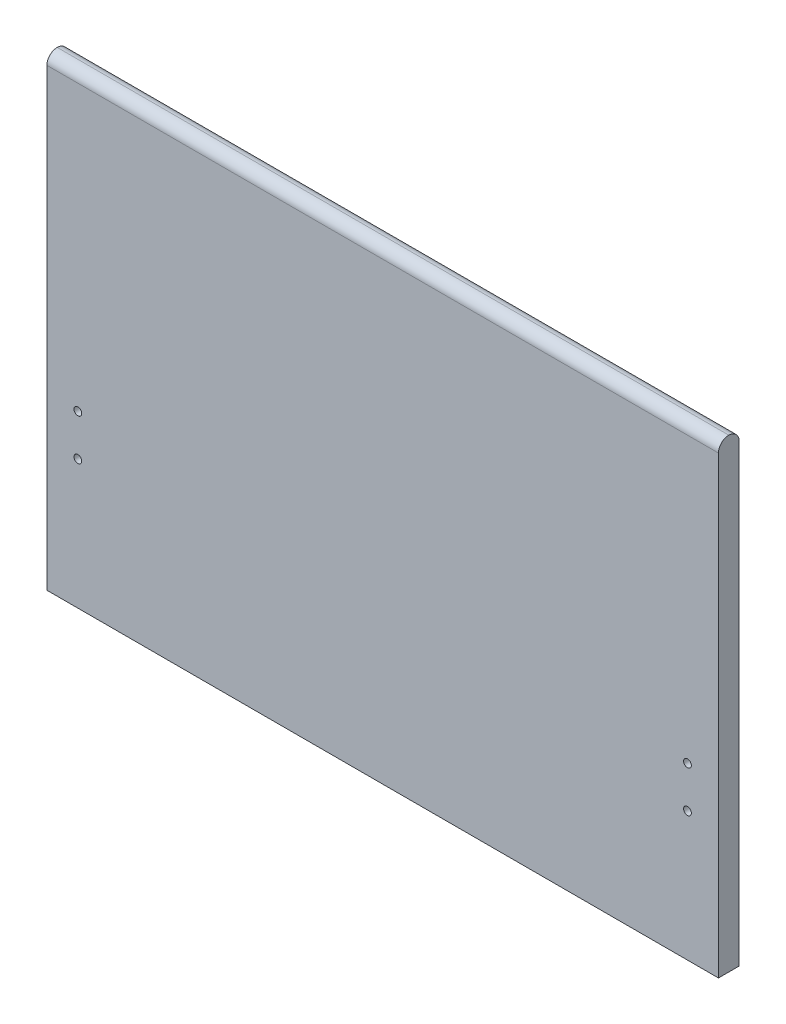
ISO-10303-21;
HEADER;
FILE_DESCRIPTION(('STEP AP214'),'2;1');
FILE_NAME('part.step','',(''),(''),'','','');
FILE_SCHEMA(('AUTOMOTIVE_DESIGN { 1 0 10303 214 1 1 1 1 }'));
ENDSEC;
DATA;
#1=APPLICATION_CONTEXT('core data for automotive mechanical design processes');
#2=APPLICATION_PROTOCOL_DEFINITION('international standard','automotive_design',2000,#1);
#3=PRODUCT_CONTEXT('',#1,'mechanical');
#4=PRODUCT('Part','Part','',(#3));
#5=PRODUCT_RELATED_PRODUCT_CATEGORY('part','',(#4));
#6=PRODUCT_DEFINITION_FORMATION('','',#4);
#7=PRODUCT_DEFINITION_CONTEXT('part definition',#1,'design');
#8=PRODUCT_DEFINITION('design','',#6,#7);
#9=PRODUCT_DEFINITION_SHAPE('','',#8);
#10=(LENGTH_UNIT() NAMED_UNIT(*) SI_UNIT(.MILLI.,.METRE.));
#11=(NAMED_UNIT(*) PLANE_ANGLE_UNIT() SI_UNIT($,.RADIAN.));
#12=(NAMED_UNIT(*) SI_UNIT($,.STERADIAN.) SOLID_ANGLE_UNIT());
#13=UNCERTAINTY_MEASURE_WITH_UNIT(LENGTH_MEASURE(1.E-05),#10,'distance_accuracy_value','');
#14=(GEOMETRIC_REPRESENTATION_CONTEXT(3) GLOBAL_UNCERTAINTY_ASSIGNED_CONTEXT((#13)) GLOBAL_UNIT_ASSIGNED_CONTEXT((#10,
#11,#12)) REPRESENTATION_CONTEXT('',''));
#15=CARTESIAN_POINT('',(0.,0.,0.));
#16=DIRECTION('',(0.,0.,1.));
#17=DIRECTION('',(1.,0.,0.));
#18=AXIS2_PLACEMENT_3D('',#15,#16,#17);
#19=CARTESIAN_POINT('',(0.,0.,40.));
#20=DIRECTION('',(1.,0.,0.));
#21=DIRECTION('',(0.,1.,0.));
#22=AXIS2_PLACEMENT_3D('',#19,#20,#21);
#23=PLANE('',#22);
#24=CARTESIAN_POINT('',(0.,-20.,20.));
#25=DIRECTION('',(1.,0.,0.));
#26=DIRECTION('',(0.,1.,0.));
#27=AXIS2_PLACEMENT_3D('',#24,#25,#26);
#28=CIRCLE('',#27,20.);
#29=CARTESIAN_POINT('',(0.,-20.,40.));
#30=VERTEX_POINT('',#29);
#31=CARTESIAN_POINT('',(0.,0.,20.));
#32=VERTEX_POINT('',#31);
#33=EDGE_CURVE('E99',#30,#32,#28,.F.);
#34=ORIENTED_EDGE('',*,*,#33,.T.);
#35=CARTESIAN_POINT('',(0.,-20.,20.));
#36=DIRECTION('',(1.,0.,0.));
#37=DIRECTION('',(0.,1.,0.));
#38=AXIS2_PLACEMENT_3D('',#35,#36,#37);
#39=CIRCLE('',#38,20.);
#40=CARTESIAN_POINT('',(0.,-20.,0.));
#41=VERTEX_POINT('',#40);
#42=EDGE_CURVE('E101',#32,#41,#39,.F.);
#43=ORIENTED_EDGE('',*,*,#42,.T.);
#44=DIRECTION('',(0.,-1.,0.));
#45=VECTOR('',#44,1.);
#46=CARTESIAN_POINT('',(0.,0.,0.));
#47=LINE('',#46,#45);
#48=CARTESIAN_POINT('',(0.,-900.,0.));
#49=VERTEX_POINT('',#48);
#50=EDGE_CURVE('E97',#41,#49,#47,.T.);
#51=ORIENTED_EDGE('',*,*,#50,.T.);
#52=DIRECTION('',(0.,0.,-1.));
#53=VECTOR('',#52,1.);
#54=CARTESIAN_POINT('',(0.,-900.,40.));
#55=LINE('',#54,#53);
#56=CARTESIAN_POINT('',(0.,-900.,40.));
#57=VERTEX_POINT('',#56);
#58=EDGE_CURVE('E91',#57,#49,#55,.T.);
#59=ORIENTED_EDGE('',*,*,#58,.F.);
#60=DIRECTION('',(0.,-1.,0.));
#61=VECTOR('',#60,1.);
#62=CARTESIAN_POINT('',(0.,0.,40.));
#63=LINE('',#62,#61);
#64=EDGE_CURVE('E77',#30,#57,#63,.T.);
#65=ORIENTED_EDGE('',*,*,#64,.F.);
#66=EDGE_LOOP('',(#34,#43,#51,#59,#65));
#67=FACE_BOUND('',#66,.T.);
#68=ADVANCED_FACE('F33',(#67),#23,.F.);
#69=CARTESIAN_POINT('',(0.,-900.,40.));
#70=DIRECTION('',(0.,1.,0.));
#71=DIRECTION('',(0.,0.,1.));
#72=AXIS2_PLACEMENT_3D('',#69,#70,#71);
#73=PLANE('',#72);
#74=DIRECTION('',(1.,0.,0.));
#75=VECTOR('',#74,1.);
#76=CARTESIAN_POINT('',(0.,-900.,0.));
#77=LINE('',#76,#75);
#78=CARTESIAN_POINT('',(1300.,-900.,0.));
#79=VERTEX_POINT('',#78);
#80=EDGE_CURVE('E118',#49,#79,#77,.T.);
#81=ORIENTED_EDGE('',*,*,#80,.T.);
#82=DIRECTION('',(0.,0.,-1.));
#83=VECTOR('',#82,1.);
#84=CARTESIAN_POINT('',(1300.,-900.,40.));
#85=LINE('',#84,#83);
#86=CARTESIAN_POINT('',(1300.,-900.,40.));
#87=VERTEX_POINT('',#86);
#88=EDGE_CURVE('E93',#87,#79,#85,.T.);
#89=ORIENTED_EDGE('',*,*,#88,.F.);
#90=DIRECTION('',(1.,0.,0.));
#91=VECTOR('',#90,1.);
#92=CARTESIAN_POINT('',(0.,-900.,40.));
#93=LINE('',#92,#91);
#94=EDGE_CURVE('E80',#57,#87,#93,.T.);
#95=ORIENTED_EDGE('',*,*,#94,.F.);
#96=ORIENTED_EDGE('',*,*,#58,.T.);
#97=EDGE_LOOP('',(#81,#89,#95,#96));
#98=FACE_BOUND('',#97,.T.);
#99=ADVANCED_FACE('F90',(#98),#73,.F.);
#100=CARTESIAN_POINT('',(1300.,0.,40.));
#101=DIRECTION('',(-1.,0.,0.));
#102=DIRECTION('',(0.,-1.,0.));
#103=AXIS2_PLACEMENT_3D('',#100,#101,#102);
#104=PLANE('',#103);
#105=DIRECTION('',(0.,1.,0.));
#106=VECTOR('',#105,1.);
#107=CARTESIAN_POINT('',(1300.,0.,0.));
#108=LINE('',#107,#106);
#109=CARTESIAN_POINT('',(1300.,-20.,0.));
#110=VERTEX_POINT('',#109);
#111=EDGE_CURVE('E86',#79,#110,#108,.T.);
#112=ORIENTED_EDGE('',*,*,#111,.T.);
#113=CARTESIAN_POINT('',(1300.,-20.,20.));
#114=DIRECTION('',(-1.,0.,0.));
#115=DIRECTION('',(0.,-1.,0.));
#116=AXIS2_PLACEMENT_3D('',#113,#114,#115);
#117=CIRCLE('',#116,20.);
#118=CARTESIAN_POINT('',(1300.,0.,20.));
#119=VERTEX_POINT('',#118);
#120=EDGE_CURVE('E42',#110,#119,#117,.F.);
#121=ORIENTED_EDGE('',*,*,#120,.T.);
#122=CARTESIAN_POINT('',(1300.,-20.,20.));
#123=DIRECTION('',(-1.,0.,0.));
#124=DIRECTION('',(0.,-1.,0.));
#125=AXIS2_PLACEMENT_3D('',#122,#123,#124);
#126=CIRCLE('',#125,20.);
#127=CARTESIAN_POINT('',(1300.,-20.,40.));
#128=VERTEX_POINT('',#127);
#129=EDGE_CURVE('E49',#119,#128,#126,.F.);
#130=ORIENTED_EDGE('',*,*,#129,.T.);
#131=DIRECTION('',(0.,1.,0.));
#132=VECTOR('',#131,1.);
#133=CARTESIAN_POINT('',(1300.,0.,40.));
#134=LINE('',#133,#132);
#135=EDGE_CURVE('E94',#87,#128,#134,.T.);
#136=ORIENTED_EDGE('',*,*,#135,.F.);
#137=ORIENTED_EDGE('',*,*,#88,.T.);
#138=EDGE_LOOP('',(#112,#121,#130,#136,#137));
#139=FACE_BOUND('',#138,.T.);
#140=ADVANCED_FACE('F117',(#139),#104,.F.);
#141=CARTESIAN_POINT('',(0.,0.,40.));
#142=DIRECTION('',(0.,0.,1.));
#143=DIRECTION('',(1.,0.,0.));
#144=AXIS2_PLACEMENT_3D('',#141,#142,#143);
#145=PLANE('',#144);
#146=CARTESIAN_POINT('',(60.,-570.,40.));
#147=DIRECTION('',(0.,0.,1.));
#148=DIRECTION('',(1.,0.,0.));
#149=AXIS2_PLACEMENT_3D('',#146,#147,#148);
#150=CIRCLE('',#149,7.50000000000001);
#151=CARTESIAN_POINT('',(67.5,-570.,40.));
#152=VERTEX_POINT('',#151);
#153=EDGE_CURVE('E142',#152,#152,#150,.T.);
#154=ORIENTED_EDGE('',*,*,#153,.F.);
#155=EDGE_LOOP('',(#154));
#156=FACE_BOUND('',#155,.T.);
#157=CARTESIAN_POINT('',(1240.,-650.,40.));
#158=DIRECTION('',(0.,0.,1.));
#159=DIRECTION('',(1.,0.,0.));
#160=AXIS2_PLACEMENT_3D('',#157,#158,#159);
#161=CIRCLE('',#160,7.49999999999996);
#162=CARTESIAN_POINT('',(1247.5,-650.,40.));
#163=VERTEX_POINT('',#162);
#164=EDGE_CURVE('E136',#163,#163,#161,.T.);
#165=ORIENTED_EDGE('',*,*,#164,.F.);
#166=EDGE_LOOP('',(#165));
#167=FACE_BOUND('',#166,.T.);
#168=CARTESIAN_POINT('',(1240.,-570.,40.));
#169=DIRECTION('',(0.,0.,1.));
#170=DIRECTION('',(1.,0.,0.));
#171=AXIS2_PLACEMENT_3D('',#168,#169,#170);
#172=CIRCLE('',#171,7.49999999999996);
#173=CARTESIAN_POINT('',(1247.5,-570.,40.));
#174=VERTEX_POINT('',#173);
#175=EDGE_CURVE('E130',#174,#174,#172,.T.);
#176=ORIENTED_EDGE('',*,*,#175,.F.);
#177=EDGE_LOOP('',(#176));
#178=FACE_BOUND('',#177,.T.);
#179=CARTESIAN_POINT('',(60.,-650.,40.));
#180=DIRECTION('',(0.,0.,1.));
#181=DIRECTION('',(1.,0.,0.));
#182=AXIS2_PLACEMENT_3D('',#179,#180,#181);
#183=CIRCLE('',#182,7.50000000000001);
#184=CARTESIAN_POINT('',(67.5,-650.,40.));
#185=VERTEX_POINT('',#184);
#186=EDGE_CURVE('E123',#185,#185,#183,.T.);
#187=ORIENTED_EDGE('',*,*,#186,.F.);
#188=EDGE_LOOP('',(#187));
#189=FACE_BOUND('',#188,.T.);
#190=ORIENTED_EDGE('',*,*,#135,.T.);
#191=DIRECTION('',(-1.,0.,0.));
#192=VECTOR('',#191,1.);
#193=CARTESIAN_POINT('',(0.,-20.,40.));
#194=LINE('',#193,#192);
#195=EDGE_CURVE('E11',#128,#30,#194,.T.);
#196=ORIENTED_EDGE('',*,*,#195,.T.);
#197=ORIENTED_EDGE('',*,*,#64,.T.);
#198=ORIENTED_EDGE('',*,*,#94,.T.);
#199=EDGE_LOOP('',(#190,#196,#197,#198));
#200=FACE_BOUND('',#199,.T.);
#201=ADVANCED_FACE('F79',(#156,#167,#178,#189,#200),#145,.T.);
#202=CARTESIAN_POINT('',(0.,0.,0.));
#203=DIRECTION('',(0.,0.,1.));
#204=DIRECTION('',(1.,0.,0.));
#205=AXIS2_PLACEMENT_3D('',#202,#203,#204);
#206=PLANE('',#205);
#207=ORIENTED_EDGE('',*,*,#50,.F.);
#208=DIRECTION('',(-1.,0.,0.));
#209=VECTOR('',#208,1.);
#210=CARTESIAN_POINT('',(0.,-20.,0.));
#211=LINE('',#210,#209);
#212=EDGE_CURVE('E107',#41,#110,#211,.F.);
#213=ORIENTED_EDGE('',*,*,#212,.T.);
#214=ORIENTED_EDGE('',*,*,#111,.F.);
#215=ORIENTED_EDGE('',*,*,#80,.F.);
#216=EDGE_LOOP('',(#207,#213,#214,#215));
#217=FACE_BOUND('',#216,.T.);
#218=ADVANCED_FACE('F114',(#217),#206,.F.);
#219=CARTESIAN_POINT('',(0.,-20.,20.));
#220=DIRECTION('',(1.,0.,0.));
#221=DIRECTION('',(0.,0.,-1.));
#222=AXIS2_PLACEMENT_3D('',#219,#220,#221);
#223=CYLINDRICAL_SURFACE('',#222,20.);
#224=ORIENTED_EDGE('',*,*,#195,.F.);
#225=ORIENTED_EDGE('',*,*,#129,.F.);
#226=DIRECTION('',(-1.,0.,0.));
#227=VECTOR('',#226,1.);
#228=CARTESIAN_POINT('',(1300.,0.,20.));
#229=LINE('',#228,#227);
#230=EDGE_CURVE('E37',#32,#119,#229,.F.);
#231=ORIENTED_EDGE('',*,*,#230,.F.);
#232=ORIENTED_EDGE('',*,*,#33,.F.);
#233=EDGE_LOOP('',(#224,#225,#231,#232));
#234=FACE_BOUND('',#233,.T.);
#235=ADVANCED_FACE('F35',(#234),#223,.T.);
#236=CARTESIAN_POINT('',(0.,-20.,20.));
#237=DIRECTION('',(-1.,0.,0.));
#238=DIRECTION('',(0.,0.,1.));
#239=AXIS2_PLACEMENT_3D('',#236,#237,#238);
#240=CYLINDRICAL_SURFACE('',#239,20.);
#241=ORIENTED_EDGE('',*,*,#120,.F.);
#242=ORIENTED_EDGE('',*,*,#212,.F.);
#243=ORIENTED_EDGE('',*,*,#42,.F.);
#244=ORIENTED_EDGE('',*,*,#230,.T.);
#245=EDGE_LOOP('',(#241,#242,#243,#244));
#246=FACE_BOUND('',#245,.T.);
#247=ADVANCED_FACE('F169',(#246),#240,.T.);
#248=CARTESIAN_POINT('',(60.,-650.,10.));
#249=DIRECTION('',(0.,0.,1.));
#250=DIRECTION('',(1.,0.,0.));
#251=AXIS2_PLACEMENT_3D('',#248,#249,#250);
#252=CYLINDRICAL_SURFACE('',#251,7.50000000000001);
#253=CARTESIAN_POINT('',(60.,-650.,10.));
#254=DIRECTION('',(0.,0.,1.));
#255=DIRECTION('',(1.,0.,0.));
#256=AXIS2_PLACEMENT_3D('',#253,#254,#255);
#257=CIRCLE('',#256,7.50000000000001);
#258=CARTESIAN_POINT('',(67.5,-650.,10.));
#259=VERTEX_POINT('',#258);
#260=EDGE_CURVE('E126',#259,#259,#257,.T.);
#261=ORIENTED_EDGE('',*,*,#260,.F.);
#262=EDGE_LOOP('',(#261));
#263=FACE_BOUND('',#262,.T.);
#264=ORIENTED_EDGE('',*,*,#186,.T.);
#265=EDGE_LOOP('',(#264));
#266=FACE_BOUND('',#265,.T.);
#267=ADVANCED_FACE('F166',(#263,#266),#252,.F.);
#268=CARTESIAN_POINT('',(60.,-650.,10.));
#269=DIRECTION('',(0.,0.,1.));
#270=DIRECTION('',(1.,0.,0.));
#271=AXIS2_PLACEMENT_3D('',#268,#269,#270);
#272=PLANE('',#271);
#273=ORIENTED_EDGE('',*,*,#260,.T.);
#274=EDGE_LOOP('',(#273));
#275=FACE_BOUND('',#274,.T.);
#276=ADVANCED_FACE('F168',(#275),#272,.T.);
#277=CARTESIAN_POINT('',(1240.,-570.,10.));
#278=DIRECTION('',(0.,0.,1.));
#279=DIRECTION('',(1.,0.,0.));
#280=AXIS2_PLACEMENT_3D('',#277,#278,#279);
#281=CYLINDRICAL_SURFACE('',#280,7.49999999999996);
#282=CARTESIAN_POINT('',(1240.,-570.,10.));
#283=DIRECTION('',(0.,0.,1.));
#284=DIRECTION('',(1.,0.,0.));
#285=AXIS2_PLACEMENT_3D('',#282,#283,#284);
#286=CIRCLE('',#285,7.49999999999996);
#287=CARTESIAN_POINT('',(1247.5,-570.,10.));
#288=VERTEX_POINT('',#287);
#289=EDGE_CURVE('E133',#288,#288,#286,.T.);
#290=ORIENTED_EDGE('',*,*,#289,.F.);
#291=EDGE_LOOP('',(#290));
#292=FACE_BOUND('',#291,.T.);
#293=ORIENTED_EDGE('',*,*,#175,.T.);
#294=EDGE_LOOP('',(#293));
#295=FACE_BOUND('',#294,.T.);
#296=ADVANCED_FACE('F176',(#292,#295),#281,.F.);
#297=CARTESIAN_POINT('',(1240.,-570.,10.));
#298=DIRECTION('',(0.,0.,1.));
#299=DIRECTION('',(1.,0.,0.));
#300=AXIS2_PLACEMENT_3D('',#297,#298,#299);
#301=PLANE('',#300);
#302=ORIENTED_EDGE('',*,*,#289,.T.);
#303=EDGE_LOOP('',(#302));
#304=FACE_BOUND('',#303,.T.);
#305=ADVANCED_FACE('F229',(#304),#301,.T.);
#306=CARTESIAN_POINT('',(1240.,-650.,10.));
#307=DIRECTION('',(0.,0.,1.));
#308=DIRECTION('',(1.,0.,0.));
#309=AXIS2_PLACEMENT_3D('',#306,#307,#308);
#310=CYLINDRICAL_SURFACE('',#309,7.49999999999996);
#311=CARTESIAN_POINT('',(1240.,-650.,10.));
#312=DIRECTION('',(0.,0.,1.));
#313=DIRECTION('',(1.,0.,0.));
#314=AXIS2_PLACEMENT_3D('',#311,#312,#313);
#315=CIRCLE('',#314,7.49999999999996);
#316=CARTESIAN_POINT('',(1247.5,-650.,10.));
#317=VERTEX_POINT('',#316);
#318=EDGE_CURVE('E139',#317,#317,#315,.T.);
#319=ORIENTED_EDGE('',*,*,#318,.F.);
#320=EDGE_LOOP('',(#319));
#321=FACE_BOUND('',#320,.T.);
#322=ORIENTED_EDGE('',*,*,#164,.T.);
#323=EDGE_LOOP('',(#322));
#324=FACE_BOUND('',#323,.T.);
#325=ADVANCED_FACE('F239',(#321,#324),#310,.F.);
#326=CARTESIAN_POINT('',(1240.,-650.,10.));
#327=DIRECTION('',(0.,0.,1.));
#328=DIRECTION('',(1.,0.,0.));
#329=AXIS2_PLACEMENT_3D('',#326,#327,#328);
#330=PLANE('',#329);
#331=ORIENTED_EDGE('',*,*,#318,.T.);
#332=EDGE_LOOP('',(#331));
#333=FACE_BOUND('',#332,.T.);
#334=ADVANCED_FACE('F153',(#333),#330,.T.);
#335=CARTESIAN_POINT('',(60.,-570.,10.));
#336=DIRECTION('',(0.,0.,1.));
#337=DIRECTION('',(1.,0.,0.));
#338=AXIS2_PLACEMENT_3D('',#335,#336,#337);
#339=CYLINDRICAL_SURFACE('',#338,7.50000000000001);
#340=CARTESIAN_POINT('',(60.,-570.,10.));
#341=DIRECTION('',(0.,0.,1.));
#342=DIRECTION('',(1.,0.,0.));
#343=AXIS2_PLACEMENT_3D('',#340,#341,#342);
#344=CIRCLE('',#343,7.50000000000001);
#345=CARTESIAN_POINT('',(67.5,-570.,10.));
#346=VERTEX_POINT('',#345);
#347=EDGE_CURVE('E127',#346,#346,#344,.T.);
#348=ORIENTED_EDGE('',*,*,#347,.F.);
#349=EDGE_LOOP('',(#348));
#350=FACE_BOUND('',#349,.T.);
#351=ORIENTED_EDGE('',*,*,#153,.T.);
#352=EDGE_LOOP('',(#351));
#353=FACE_BOUND('',#352,.T.);
#354=ADVANCED_FACE('F150',(#350,#353),#339,.F.);
#355=CARTESIAN_POINT('',(60.,-570.,10.));
#356=DIRECTION('',(0.,0.,1.));
#357=DIRECTION('',(1.,0.,0.));
#358=AXIS2_PLACEMENT_3D('',#355,#356,#357);
#359=PLANE('',#358);
#360=ORIENTED_EDGE('',*,*,#347,.T.);
#361=EDGE_LOOP('',(#360));
#362=FACE_BOUND('',#361,.T.);
#363=ADVANCED_FACE('F148',(#362),#359,.T.);
#364=CLOSED_SHELL('',(#68,#99,#140,#201,#218,#235,#247,#267,#276,#296,#305,#325,#334,#354,#363));
#365=MANIFOLD_SOLID_BREP('B2',#364);
#366=ADVANCED_BREP_SHAPE_REPRESENTATION('',(#18,#365),#14);
#367=SHAPE_DEFINITION_REPRESENTATION(#9,#366);
ENDSEC;
END-ISO-10303-21;
